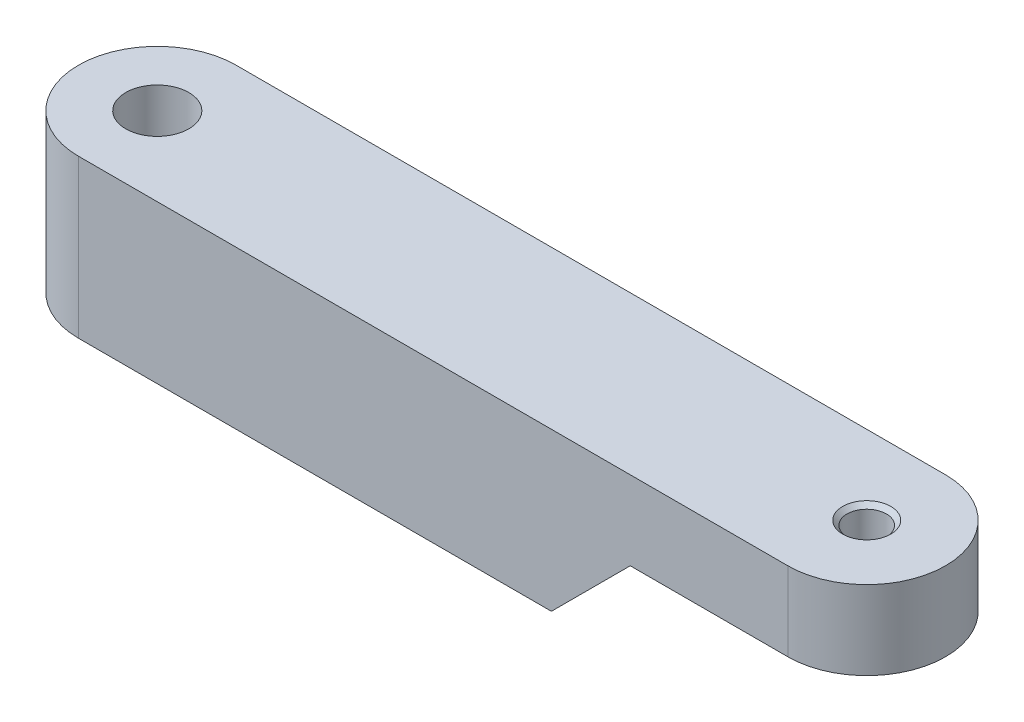
ISO-10303-21;
HEADER;
FILE_DESCRIPTION(('STEP AP214'),'2;1');
FILE_NAME('part.step','',(''),(''),'','','');
FILE_SCHEMA(('AUTOMOTIVE_DESIGN { 1 0 10303 214 1 1 1 1 }'));
ENDSEC;
DATA;
#1=APPLICATION_CONTEXT('core data for automotive mechanical design processes');
#2=APPLICATION_PROTOCOL_DEFINITION('international standard','automotive_design',2000,#1);
#3=PRODUCT_CONTEXT('',#1,'mechanical');
#4=PRODUCT('Part','Part','',(#3));
#5=PRODUCT_RELATED_PRODUCT_CATEGORY('part','',(#4));
#6=PRODUCT_DEFINITION_FORMATION('','',#4);
#7=PRODUCT_DEFINITION_CONTEXT('part definition',#1,'design');
#8=PRODUCT_DEFINITION('design','',#6,#7);
#9=PRODUCT_DEFINITION_SHAPE('','',#8);
#10=(LENGTH_UNIT() NAMED_UNIT(*) SI_UNIT(.MILLI.,.METRE.));
#11=(NAMED_UNIT(*) PLANE_ANGLE_UNIT() SI_UNIT($,.RADIAN.));
#12=(NAMED_UNIT(*) SI_UNIT($,.STERADIAN.) SOLID_ANGLE_UNIT());
#13=UNCERTAINTY_MEASURE_WITH_UNIT(LENGTH_MEASURE(1.E-05),#10,'distance_accuracy_value','');
#14=(GEOMETRIC_REPRESENTATION_CONTEXT(3) GLOBAL_UNCERTAINTY_ASSIGNED_CONTEXT((#13)) GLOBAL_UNIT_ASSIGNED_CONTEXT((#10,
#11,#12)) REPRESENTATION_CONTEXT('',''));
#15=CARTESIAN_POINT('',(0.,0.,0.));
#16=DIRECTION('',(0.,0.,1.));
#17=DIRECTION('',(1.,0.,0.));
#18=AXIS2_PLACEMENT_3D('',#15,#16,#17);
#19=CARTESIAN_POINT('',(0.,5.,0.));
#20=DIRECTION('',(0.,1.,0.));
#21=DIRECTION('',(0.,0.,1.));
#22=AXIS2_PLACEMENT_3D('',#19,#20,#21);
#23=PLANE('',#22);
#24=CARTESIAN_POINT('',(45.,5.,0.));
#25=DIRECTION('',(0.,1.,0.));
#26=DIRECTION('',(0.,0.,1.));
#27=AXIS2_PLACEMENT_3D('',#24,#25,#26);
#28=CIRCLE('',#27,1.525);
#29=CARTESIAN_POINT('',(45.,5.,1.525));
#30=VERTEX_POINT('',#29);
#31=EDGE_CURVE('E143',#30,#30,#28,.T.);
#32=ORIENTED_EDGE('',*,*,#31,.F.);
#33=EDGE_LOOP('',(#32));
#34=FACE_BOUND('',#33,.T.);
#35=CARTESIAN_POINT('',(0.,5.,0.));
#36=DIRECTION('',(0.,1.,0.));
#37=DIRECTION('',(0.,0.,1.));
#38=AXIS2_PLACEMENT_3D('',#35,#36,#37);
#39=CIRCLE('',#38,5.);
#40=CARTESIAN_POINT('',(0.,5.,-5.));
#41=VERTEX_POINT('',#40);
#42=CARTESIAN_POINT('',(0.,5.,5.));
#43=VERTEX_POINT('',#42);
#44=EDGE_CURVE('E116',#41,#43,#39,.T.);
#45=ORIENTED_EDGE('',*,*,#44,.T.);
#46=DIRECTION('',(1.,0.,0.));
#47=VECTOR('',#46,1.);
#48=CARTESIAN_POINT('',(0.,5.,5.));
#49=LINE('',#48,#47);
#50=CARTESIAN_POINT('',(45.,5.,5.));
#51=VERTEX_POINT('',#50);
#52=EDGE_CURVE('E80',#43,#51,#49,.T.);
#53=ORIENTED_EDGE('',*,*,#52,.T.);
#54=CARTESIAN_POINT('',(45.,5.,0.));
#55=DIRECTION('',(0.,1.,0.));
#56=DIRECTION('',(0.,0.,-1.));
#57=AXIS2_PLACEMENT_3D('',#54,#55,#56);
#58=CIRCLE('',#57,5.);
#59=CARTESIAN_POINT('',(45.,5.,-5.));
#60=VERTEX_POINT('',#59);
#61=EDGE_CURVE('E134',#51,#60,#58,.T.);
#62=ORIENTED_EDGE('',*,*,#61,.T.);
#63=DIRECTION('',(-1.,0.,0.));
#64=VECTOR('',#63,1.);
#65=CARTESIAN_POINT('',(0.,5.,-5.));
#66=LINE('',#65,#64);
#67=EDGE_CURVE('E59',#60,#41,#66,.T.);
#68=ORIENTED_EDGE('',*,*,#67,.T.);
#69=EDGE_LOOP('',(#45,#53,#62,#68));
#70=FACE_BOUND('',#69,.T.);
#71=CARTESIAN_POINT('',(0.,5.,0.));
#72=DIRECTION('',(0.,1.,0.));
#73=DIRECTION('',(0.,0.,1.));
#74=AXIS2_PLACEMENT_3D('',#71,#72,#73);
#75=CIRCLE('',#74,2.);
#76=CARTESIAN_POINT('',(0.,5.,2.));
#77=VERTEX_POINT('',#76);
#78=EDGE_CURVE('E118',#77,#77,#75,.T.);
#79=ORIENTED_EDGE('',*,*,#78,.F.);
#80=EDGE_LOOP('',(#79));
#81=FACE_BOUND('',#80,.T.);
#82=ADVANCED_FACE('F34',(#34,#70,#81),#23,.T.);
#83=CARTESIAN_POINT('',(0.,-5.,0.));
#84=DIRECTION('',(0.,1.,0.));
#85=DIRECTION('',(0.,0.,1.));
#86=AXIS2_PLACEMENT_3D('',#83,#84,#85);
#87=PLANE('',#86);
#88=DIRECTION('',(-1.,0.,0.));
#89=VECTOR('',#88,1.);
#90=CARTESIAN_POINT('',(0.,-5.,-5.));
#91=LINE('',#90,#89);
#92=CARTESIAN_POINT('',(30.,-5.,-5.));
#93=VERTEX_POINT('',#92);
#94=CARTESIAN_POINT('',(0.,-5.,-5.));
#95=VERTEX_POINT('',#94);
#96=EDGE_CURVE('E73',#93,#95,#91,.T.);
#97=ORIENTED_EDGE('',*,*,#96,.F.);
#98=DIRECTION('',(0.,0.,1.));
#99=VECTOR('',#98,1.);
#100=CARTESIAN_POINT('',(30.,-5.,-5.));
#101=LINE('',#100,#99);
#102=CARTESIAN_POINT('',(30.,-5.,5.));
#103=VERTEX_POINT('',#102);
#104=EDGE_CURVE('E98',#93,#103,#101,.T.);
#105=ORIENTED_EDGE('',*,*,#104,.T.);
#106=DIRECTION('',(1.,0.,0.));
#107=VECTOR('',#106,1.);
#108=CARTESIAN_POINT('',(0.,-5.,5.));
#109=LINE('',#108,#107);
#110=CARTESIAN_POINT('',(0.,-5.,5.));
#111=VERTEX_POINT('',#110);
#112=EDGE_CURVE('E108',#111,#103,#109,.T.);
#113=ORIENTED_EDGE('',*,*,#112,.F.);
#114=CARTESIAN_POINT('',(0.,-5.,0.));
#115=DIRECTION('',(0.,1.,0.));
#116=DIRECTION('',(0.,0.,1.));
#117=AXIS2_PLACEMENT_3D('',#114,#115,#116);
#118=CIRCLE('',#117,5.);
#119=EDGE_CURVE('E114',#95,#111,#118,.T.);
#120=ORIENTED_EDGE('',*,*,#119,.F.);
#121=EDGE_LOOP('',(#97,#105,#113,#120));
#122=FACE_BOUND('',#121,.T.);
#123=CARTESIAN_POINT('',(0.,-5.,0.));
#124=DIRECTION('',(0.,1.,0.));
#125=DIRECTION('',(0.,0.,1.));
#126=AXIS2_PLACEMENT_3D('',#123,#124,#125);
#127=CIRCLE('',#126,2.);
#128=CARTESIAN_POINT('',(0.,-5.,2.));
#129=VERTEX_POINT('',#128);
#130=EDGE_CURVE('E149',#129,#129,#127,.T.);
#131=ORIENTED_EDGE('',*,*,#130,.T.);
#132=EDGE_LOOP('',(#131));
#133=FACE_BOUND('',#132,.T.);
#134=ADVANCED_FACE('F105',(#122,#133),#87,.F.);
#135=CARTESIAN_POINT('',(0.,5.,0.));
#136=DIRECTION('',(0.,-1.,0.));
#137=DIRECTION('',(0.,0.,-1.));
#138=AXIS2_PLACEMENT_3D('',#135,#136,#137);
#139=CYLINDRICAL_SURFACE('',#138,5.);
#140=ORIENTED_EDGE('',*,*,#119,.T.);
#141=DIRECTION('',(0.,-1.,0.));
#142=VECTOR('',#141,1.);
#143=CARTESIAN_POINT('',(0.,5.,5.));
#144=LINE('',#143,#142);
#145=EDGE_CURVE('E11',#43,#111,#144,.T.);
#146=ORIENTED_EDGE('',*,*,#145,.F.);
#147=ORIENTED_EDGE('',*,*,#44,.F.);
#148=DIRECTION('',(0.,-1.,0.));
#149=VECTOR('',#148,1.);
#150=CARTESIAN_POINT('',(0.,5.,-5.));
#151=LINE('',#150,#149);
#152=EDGE_CURVE('E122',#41,#95,#151,.T.);
#153=ORIENTED_EDGE('',*,*,#152,.T.);
#154=EDGE_LOOP('',(#140,#146,#147,#153));
#155=FACE_BOUND('',#154,.T.);
#156=ADVANCED_FACE('F36',(#155),#139,.T.);
#157=CARTESIAN_POINT('',(0.,5.,5.));
#158=DIRECTION('',(0.,0.,-1.));
#159=DIRECTION('',(-1.,0.,0.));
#160=AXIS2_PLACEMENT_3D('',#157,#158,#159);
#161=PLANE('',#160);
#162=ORIENTED_EDGE('',*,*,#112,.T.);
#163=DIRECTION('',(-0.707106781186552,-0.707106781186544,0.));
#164=VECTOR('',#163,1.);
#165=CARTESIAN_POINT('',(35.,0.,5.));
#166=LINE('',#165,#164);
#167=CARTESIAN_POINT('',(35.,0.,5.));
#168=VERTEX_POINT('',#167);
#169=EDGE_CURVE('E95',#168,#103,#166,.T.);
#170=ORIENTED_EDGE('',*,*,#169,.F.);
#171=DIRECTION('',(-1.,0.,0.));
#172=VECTOR('',#171,1.);
#173=CARTESIAN_POINT('',(35.,0.,5.));
#174=LINE('',#173,#172);
#175=CARTESIAN_POINT('',(45.,0.,5.));
#176=VERTEX_POINT('',#175);
#177=EDGE_CURVE('E102',#176,#168,#174,.T.);
#178=ORIENTED_EDGE('',*,*,#177,.F.);
#179=DIRECTION('',(0.,-1.,0.));
#180=VECTOR('',#179,1.);
#181=CARTESIAN_POINT('',(45.,5.,5.));
#182=LINE('',#181,#180);
#183=EDGE_CURVE('E43',#51,#176,#182,.T.);
#184=ORIENTED_EDGE('',*,*,#183,.F.);
#185=ORIENTED_EDGE('',*,*,#52,.F.);
#186=ORIENTED_EDGE('',*,*,#145,.T.);
#187=EDGE_LOOP('',(#162,#170,#178,#184,#185,#186));
#188=FACE_BOUND('',#187,.T.);
#189=ADVANCED_FACE('F111',(#188),#161,.F.);
#190=CARTESIAN_POINT('',(45.,5.,0.));
#191=DIRECTION('',(0.,-1.,0.));
#192=DIRECTION('',(0.,0.,-1.));
#193=AXIS2_PLACEMENT_3D('',#190,#191,#192);
#194=CYLINDRICAL_SURFACE('',#193,5.);
#195=ORIENTED_EDGE('',*,*,#183,.T.);
#196=CARTESIAN_POINT('',(45.,0.,0.));
#197=DIRECTION('',(0.,1.,0.));
#198=DIRECTION('',(0.,0.,1.));
#199=AXIS2_PLACEMENT_3D('',#196,#197,#198);
#200=CIRCLE('',#199,5.);
#201=CARTESIAN_POINT('',(45.,0.,-5.));
#202=VERTEX_POINT('',#201);
#203=EDGE_CURVE('E132',#176,#202,#200,.T.);
#204=ORIENTED_EDGE('',*,*,#203,.T.);
#205=DIRECTION('',(0.,-1.,0.));
#206=VECTOR('',#205,1.);
#207=CARTESIAN_POINT('',(45.,5.,-5.));
#208=LINE('',#207,#206);
#209=EDGE_CURVE('E124',#60,#202,#208,.T.);
#210=ORIENTED_EDGE('',*,*,#209,.F.);
#211=ORIENTED_EDGE('',*,*,#61,.F.);
#212=EDGE_LOOP('',(#195,#204,#210,#211));
#213=FACE_BOUND('',#212,.T.);
#214=ADVANCED_FACE('F130',(#213),#194,.T.);
#215=CARTESIAN_POINT('',(0.,5.,-5.));
#216=DIRECTION('',(0.,0.,1.));
#217=DIRECTION('',(1.,0.,0.));
#218=AXIS2_PLACEMENT_3D('',#215,#216,#217);
#219=PLANE('',#218);
#220=DIRECTION('',(-1.,0.,0.));
#221=VECTOR('',#220,1.);
#222=CARTESIAN_POINT('',(35.,0.,-5.));
#223=LINE('',#222,#221);
#224=CARTESIAN_POINT('',(35.,0.,-5.));
#225=VERTEX_POINT('',#224);
#226=EDGE_CURVE('E109',#202,#225,#223,.T.);
#227=ORIENTED_EDGE('',*,*,#226,.T.);
#228=DIRECTION('',(-0.707106781186552,-0.707106781186544,0.));
#229=VECTOR('',#228,1.);
#230=CARTESIAN_POINT('',(35.,0.,-5.));
#231=LINE('',#230,#229);
#232=EDGE_CURVE('E50',#225,#93,#231,.T.);
#233=ORIENTED_EDGE('',*,*,#232,.T.);
#234=ORIENTED_EDGE('',*,*,#96,.T.);
#235=ORIENTED_EDGE('',*,*,#152,.F.);
#236=ORIENTED_EDGE('',*,*,#67,.F.);
#237=ORIENTED_EDGE('',*,*,#209,.T.);
#238=EDGE_LOOP('',(#227,#233,#234,#235,#236,#237));
#239=FACE_BOUND('',#238,.T.);
#240=ADVANCED_FACE('F157',(#239),#219,.F.);
#241=CARTESIAN_POINT('',(0.,5.,0.));
#242=DIRECTION('',(0.,-1.,0.));
#243=DIRECTION('',(0.,0.,-1.));
#244=AXIS2_PLACEMENT_3D('',#241,#242,#243);
#245=CYLINDRICAL_SURFACE('',#244,2.);
#246=ORIENTED_EDGE('',*,*,#78,.T.);
#247=EDGE_LOOP('',(#246));
#248=FACE_BOUND('',#247,.T.);
#249=ORIENTED_EDGE('',*,*,#130,.F.);
#250=EDGE_LOOP('',(#249));
#251=FACE_BOUND('',#250,.T.);
#252=ADVANCED_FACE('F173',(#248,#251),#245,.F.);
#253=CARTESIAN_POINT('',(45.,5.,0.));
#254=DIRECTION('',(0.,1.,0.));
#255=DIRECTION('',(0.,0.,1.));
#256=AXIS2_PLACEMENT_3D('',#253,#254,#255);
#257=CYLINDRICAL_SURFACE('',#256,1.25);
#258=CARTESIAN_POINT('',(45.,0.,0.));
#259=DIRECTION('',(0.,1.,0.));
#260=DIRECTION('',(0.,0.,1.));
#261=AXIS2_PLACEMENT_3D('',#258,#259,#260);
#262=CIRCLE('',#261,1.25);
#263=CARTESIAN_POINT('',(45.,0.,1.25));
#264=VERTEX_POINT('',#263);
#265=EDGE_CURVE('E38',#264,#264,#262,.F.);
#266=ORIENTED_EDGE('',*,*,#265,.T.);
#267=EDGE_LOOP('',(#266));
#268=FACE_BOUND('',#267,.T.);
#269=CARTESIAN_POINT('',(45.,4.725,0.));
#270=DIRECTION('',(0.,1.,0.));
#271=DIRECTION('',(0.,0.,1.));
#272=AXIS2_PLACEMENT_3D('',#269,#270,#271);
#273=CIRCLE('',#272,1.25);
#274=CARTESIAN_POINT('',(45.,4.725,1.25));
#275=VERTEX_POINT('',#274);
#276=EDGE_CURVE('E146',#275,#275,#273,.T.);
#277=ORIENTED_EDGE('',*,*,#276,.T.);
#278=EDGE_LOOP('',(#277));
#279=FACE_BOUND('',#278,.T.);
#280=ADVANCED_FACE('F194',(#268,#279),#257,.F.);
#281=CARTESIAN_POINT('',(45.,5.,0.));
#282=DIRECTION('',(0.,1.,0.));
#283=DIRECTION('',(0.,0.,1.));
#284=AXIS2_PLACEMENT_3D('',#281,#282,#283);
#285=CONICAL_SURFACE('',#284,1.525,0.785398163397442);
#286=ORIENTED_EDGE('',*,*,#276,.F.);
#287=EDGE_LOOP('',(#286));
#288=FACE_BOUND('',#287,.T.);
#289=ORIENTED_EDGE('',*,*,#31,.T.);
#290=EDGE_LOOP('',(#289));
#291=FACE_BOUND('',#290,.T.);
#292=ADVANCED_FACE('F201',(#288,#291),#285,.F.);
#293=CARTESIAN_POINT('',(35.,0.,-5.));
#294=DIRECTION('',(0.,1.,0.));
#295=DIRECTION('',(0.,0.,1.));
#296=AXIS2_PLACEMENT_3D('',#293,#294,#295);
#297=PLANE('',#296);
#298=ORIENTED_EDGE('',*,*,#265,.F.);
#299=EDGE_LOOP('',(#298));
#300=FACE_BOUND('',#299,.T.);
#301=ORIENTED_EDGE('',*,*,#177,.T.);
#302=DIRECTION('',(0.,0.,1.));
#303=VECTOR('',#302,1.);
#304=CARTESIAN_POINT('',(35.,0.,-5.));
#305=LINE('',#304,#303);
#306=EDGE_CURVE('E99',#225,#168,#305,.T.);
#307=ORIENTED_EDGE('',*,*,#306,.F.);
#308=ORIENTED_EDGE('',*,*,#226,.F.);
#309=ORIENTED_EDGE('',*,*,#203,.F.);
#310=EDGE_LOOP('',(#301,#307,#308,#309));
#311=FACE_BOUND('',#310,.T.);
#312=ADVANCED_FACE('F207',(#300,#311),#297,.F.);
#313=CARTESIAN_POINT('',(35.,0.,-5.));
#314=DIRECTION('',(-0.707106781186544,0.707106781186552,0.));
#315=DIRECTION('',(-0.707106781186552,-0.707106781186544,0.));
#316=AXIS2_PLACEMENT_3D('',#313,#314,#315);
#317=PLANE('',#316);
#318=ORIENTED_EDGE('',*,*,#104,.F.);
#319=ORIENTED_EDGE('',*,*,#232,.F.);
#320=ORIENTED_EDGE('',*,*,#306,.T.);
#321=ORIENTED_EDGE('',*,*,#169,.T.);
#322=EDGE_LOOP('',(#318,#319,#320,#321));
#323=FACE_BOUND('',#322,.T.);
#324=ADVANCED_FACE('F97',(#323),#317,.F.);
#325=CLOSED_SHELL('',(#82,#134,#156,#189,#214,#240,#252,#280,#292,#312,#324));
#326=MANIFOLD_SOLID_BREP('B2',#325);
#327=ADVANCED_BREP_SHAPE_REPRESENTATION('',(#18,#326),#14);
#328=SHAPE_DEFINITION_REPRESENTATION(#9,#327);
ENDSEC;
END-ISO-10303-21;
